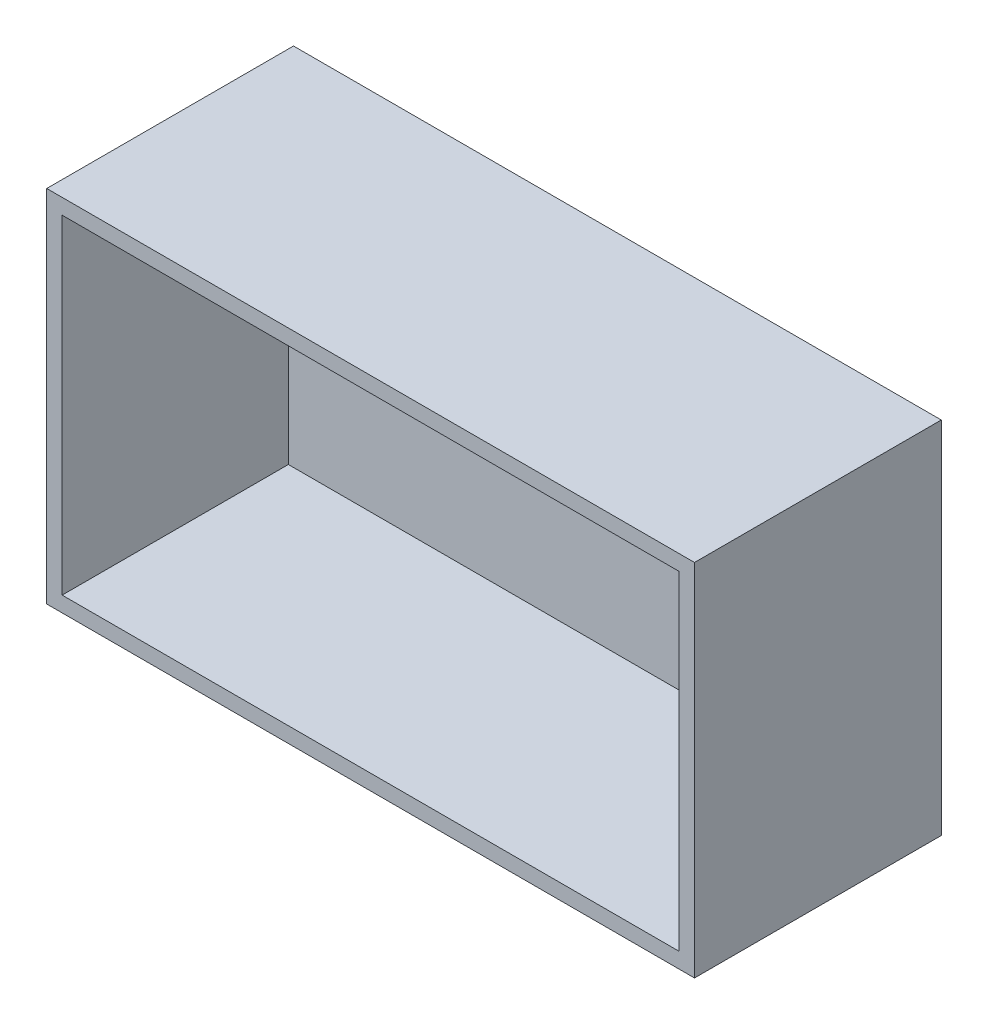
ISO-10303-21;
HEADER;
FILE_DESCRIPTION(('STEP AP214'),'2;1');
FILE_NAME('part.step','',(''),(''),'','','');
FILE_SCHEMA(('AUTOMOTIVE_DESIGN { 1 0 10303 214 1 1 1 1 }'));
ENDSEC;
DATA;
#1=APPLICATION_CONTEXT('core data for automotive mechanical design processes');
#2=APPLICATION_PROTOCOL_DEFINITION('international standard','automotive_design',2000,#1);
#3=PRODUCT_CONTEXT('',#1,'mechanical');
#4=PRODUCT('Part','Part','',(#3));
#5=PRODUCT_RELATED_PRODUCT_CATEGORY('part','',(#4));
#6=PRODUCT_DEFINITION_FORMATION('','',#4);
#7=PRODUCT_DEFINITION_CONTEXT('part definition',#1,'design');
#8=PRODUCT_DEFINITION('design','',#6,#7);
#9=PRODUCT_DEFINITION_SHAPE('','',#8);
#10=(LENGTH_UNIT() NAMED_UNIT(*) SI_UNIT(.MILLI.,.METRE.));
#11=(NAMED_UNIT(*) PLANE_ANGLE_UNIT() SI_UNIT($,.RADIAN.));
#12=(NAMED_UNIT(*) SI_UNIT($,.STERADIAN.) SOLID_ANGLE_UNIT());
#13=UNCERTAINTY_MEASURE_WITH_UNIT(LENGTH_MEASURE(1.E-05),#10,'distance_accuracy_value','');
#14=(GEOMETRIC_REPRESENTATION_CONTEXT(3) GLOBAL_UNCERTAINTY_ASSIGNED_CONTEXT((#13)) GLOBAL_UNIT_ASSIGNED_CONTEXT((#10,
#11,#12)) REPRESENTATION_CONTEXT('',''));
#15=CARTESIAN_POINT('',(0.,0.,0.));
#16=DIRECTION('',(0.,0.,1.));
#17=DIRECTION('',(1.,0.,0.));
#18=AXIS2_PLACEMENT_3D('',#15,#16,#17);
#19=CARTESIAN_POINT('',(31.5,17.5,24.));
#20=DIRECTION('',(-1.,0.,0.));
#21=DIRECTION('',(0.,0.,1.));
#22=AXIS2_PLACEMENT_3D('',#19,#20,#21);
#23=PLANE('',#22);
#24=DIRECTION('',(0.,1.,0.));
#25=VECTOR('',#24,1.);
#26=CARTESIAN_POINT('',(31.5,17.5,0.));
#27=LINE('',#26,#25);
#28=CARTESIAN_POINT('',(31.5,-17.5,0.));
#29=VERTEX_POINT('',#28);
#30=CARTESIAN_POINT('',(31.5,17.5,0.));
#31=VERTEX_POINT('',#30);
#32=EDGE_CURVE('E162',#29,#31,#27,.T.);
#33=ORIENTED_EDGE('',*,*,#32,.T.);
#34=DIRECTION('',(0.,0.,-1.));
#35=VECTOR('',#34,1.);
#36=CARTESIAN_POINT('',(31.5,17.5,24.));
#37=LINE('',#36,#35);
#38=CARTESIAN_POINT('',(31.5,17.5,24.));
#39=VERTEX_POINT('',#38);
#40=EDGE_CURVE('E11',#39,#31,#37,.T.);
#41=ORIENTED_EDGE('',*,*,#40,.F.);
#42=DIRECTION('',(0.,1.,0.));
#43=VECTOR('',#42,1.);
#44=CARTESIAN_POINT('',(31.5,17.5,24.));
#45=LINE('',#44,#43);
#46=CARTESIAN_POINT('',(31.5,-17.5,24.));
#47=VERTEX_POINT('',#46);
#48=EDGE_CURVE('E168',#47,#39,#45,.T.);
#49=ORIENTED_EDGE('',*,*,#48,.F.);
#50=DIRECTION('',(0.,0.,-1.));
#51=VECTOR('',#50,1.);
#52=CARTESIAN_POINT('',(31.5,-17.5,24.));
#53=LINE('',#52,#51);
#54=EDGE_CURVE('E178',#47,#29,#53,.T.);
#55=ORIENTED_EDGE('',*,*,#54,.T.);
#56=EDGE_LOOP('',(#33,#41,#49,#55));
#57=FACE_BOUND('',#56,.T.);
#58=ADVANCED_FACE('F43',(#57),#23,.F.);
#59=CARTESIAN_POINT('',(-31.5,17.5,24.));
#60=DIRECTION('',(0.,-1.,0.));
#61=DIRECTION('',(0.,0.,-1.));
#62=AXIS2_PLACEMENT_3D('',#59,#60,#61);
#63=PLANE('',#62);
#64=DIRECTION('',(-1.,0.,0.));
#65=VECTOR('',#64,1.);
#66=CARTESIAN_POINT('',(-31.5,17.5,0.));
#67=LINE('',#66,#65);
#68=CARTESIAN_POINT('',(-31.5,17.5,0.));
#69=VERTEX_POINT('',#68);
#70=EDGE_CURVE('E182',#31,#69,#67,.T.);
#71=ORIENTED_EDGE('',*,*,#70,.T.);
#72=DIRECTION('',(0.,0.,-1.));
#73=VECTOR('',#72,1.);
#74=CARTESIAN_POINT('',(-31.5,17.5,24.));
#75=LINE('',#74,#73);
#76=CARTESIAN_POINT('',(-31.5,17.5,24.));
#77=VERTEX_POINT('',#76);
#78=EDGE_CURVE('E51',#77,#69,#75,.T.);
#79=ORIENTED_EDGE('',*,*,#78,.F.);
#80=DIRECTION('',(-1.,0.,0.));
#81=VECTOR('',#80,1.);
#82=CARTESIAN_POINT('',(-31.5,17.5,24.));
#83=LINE('',#82,#81);
#84=EDGE_CURVE('E95',#39,#77,#83,.T.);
#85=ORIENTED_EDGE('',*,*,#84,.F.);
#86=ORIENTED_EDGE('',*,*,#40,.T.);
#87=EDGE_LOOP('',(#71,#79,#85,#86));
#88=FACE_BOUND('',#87,.T.);
#89=ADVANCED_FACE('F217',(#88),#63,.F.);
#90=CARTESIAN_POINT('',(-31.5,17.5,24.));
#91=DIRECTION('',(1.,0.,0.));
#92=DIRECTION('',(0.,1.,0.));
#93=AXIS2_PLACEMENT_3D('',#90,#91,#92);
#94=PLANE('',#93);
#95=DIRECTION('',(0.,-1.,0.));
#96=VECTOR('',#95,1.);
#97=CARTESIAN_POINT('',(-31.5,17.5,0.));
#98=LINE('',#97,#96);
#99=CARTESIAN_POINT('',(-31.5,-17.5,0.));
#100=VERTEX_POINT('',#99);
#101=EDGE_CURVE('E185',#69,#100,#98,.T.);
#102=ORIENTED_EDGE('',*,*,#101,.T.);
#103=DIRECTION('',(0.,0.,-1.));
#104=VECTOR('',#103,1.);
#105=CARTESIAN_POINT('',(-31.5,-17.5,24.));
#106=LINE('',#105,#104);
#107=CARTESIAN_POINT('',(-31.5,-17.5,24.));
#108=VERTEX_POINT('',#107);
#109=EDGE_CURVE('E192',#108,#100,#106,.T.);
#110=ORIENTED_EDGE('',*,*,#109,.F.);
#111=DIRECTION('',(0.,-1.,0.));
#112=VECTOR('',#111,1.);
#113=CARTESIAN_POINT('',(-31.5,17.5,24.));
#114=LINE('',#113,#112);
#115=EDGE_CURVE('E173',#77,#108,#114,.T.);
#116=ORIENTED_EDGE('',*,*,#115,.F.);
#117=ORIENTED_EDGE('',*,*,#78,.T.);
#118=EDGE_LOOP('',(#102,#110,#116,#117));
#119=FACE_BOUND('',#118,.T.);
#120=ADVANCED_FACE('F199',(#119),#94,.F.);
#121=CARTESIAN_POINT('',(-31.5,-17.5,24.));
#122=DIRECTION('',(0.,1.,0.));
#123=DIRECTION('',(0.,0.,1.));
#124=AXIS2_PLACEMENT_3D('',#121,#122,#123);
#125=PLANE('',#124);
#126=DIRECTION('',(1.,0.,0.));
#127=VECTOR('',#126,1.);
#128=CARTESIAN_POINT('',(-31.5,-17.5,0.));
#129=LINE('',#128,#127);
#130=EDGE_CURVE('E88',#100,#29,#129,.T.);
#131=ORIENTED_EDGE('',*,*,#130,.T.);
#132=ORIENTED_EDGE('',*,*,#54,.F.);
#133=DIRECTION('',(1.,0.,0.));
#134=VECTOR('',#133,1.);
#135=CARTESIAN_POINT('',(-31.5,-17.5,24.));
#136=LINE('',#135,#134);
#137=EDGE_CURVE('E67',#108,#47,#136,.T.);
#138=ORIENTED_EDGE('',*,*,#137,.F.);
#139=ORIENTED_EDGE('',*,*,#109,.T.);
#140=EDGE_LOOP('',(#131,#132,#138,#139));
#141=FACE_BOUND('',#140,.T.);
#142=ADVANCED_FACE('F207',(#141),#125,.F.);
#143=CARTESIAN_POINT('',(0.,0.,24.));
#144=DIRECTION('',(0.,0.,1.));
#145=DIRECTION('',(1.,0.,0.));
#146=AXIS2_PLACEMENT_3D('',#143,#144,#145);
#147=PLANE('',#146);
#148=DIRECTION('',(0.,1.,0.));
#149=VECTOR('',#148,1.);
#150=CARTESIAN_POINT('',(30.,16.,24.));
#151=LINE('',#150,#149);
#152=CARTESIAN_POINT('',(30.,-16.,24.));
#153=VERTEX_POINT('',#152);
#154=CARTESIAN_POINT('',(30.,16.,24.));
#155=VERTEX_POINT('',#154);
#156=EDGE_CURVE('E58',#153,#155,#151,.T.);
#157=ORIENTED_EDGE('',*,*,#156,.F.);
#158=DIRECTION('',(1.,0.,0.));
#159=VECTOR('',#158,1.);
#160=CARTESIAN_POINT('',(-30.,-16.,24.));
#161=LINE('',#160,#159);
#162=CARTESIAN_POINT('',(-30.,-16.,24.));
#163=VERTEX_POINT('',#162);
#164=EDGE_CURVE('E140',#163,#153,#161,.T.);
#165=ORIENTED_EDGE('',*,*,#164,.F.);
#166=DIRECTION('',(0.,-1.,0.));
#167=VECTOR('',#166,1.);
#168=CARTESIAN_POINT('',(-30.,16.,24.));
#169=LINE('',#168,#167);
#170=CARTESIAN_POINT('',(-30.,16.,24.));
#171=VERTEX_POINT('',#170);
#172=EDGE_CURVE('E144',#171,#163,#169,.T.);
#173=ORIENTED_EDGE('',*,*,#172,.F.);
#174=DIRECTION('',(-1.,0.,0.));
#175=VECTOR('',#174,1.);
#176=CARTESIAN_POINT('',(-30.,16.,24.));
#177=LINE('',#176,#175);
#178=EDGE_CURVE('E153',#155,#171,#177,.T.);
#179=ORIENTED_EDGE('',*,*,#178,.F.);
#180=EDGE_LOOP('',(#157,#165,#173,#179));
#181=FACE_BOUND('',#180,.T.);
#182=ORIENTED_EDGE('',*,*,#48,.T.);
#183=ORIENTED_EDGE('',*,*,#84,.T.);
#184=ORIENTED_EDGE('',*,*,#115,.T.);
#185=ORIENTED_EDGE('',*,*,#137,.T.);
#186=EDGE_LOOP('',(#182,#183,#184,#185));
#187=FACE_BOUND('',#186,.T.);
#188=ADVANCED_FACE('F209',(#181,#187),#147,.T.);
#189=CARTESIAN_POINT('',(0.,0.,0.));
#190=DIRECTION('',(0.,0.,1.));
#191=DIRECTION('',(1.,0.,0.));
#192=AXIS2_PLACEMENT_3D('',#189,#190,#191);
#193=PLANE('',#192);
#194=ORIENTED_EDGE('',*,*,#32,.F.);
#195=ORIENTED_EDGE('',*,*,#130,.F.);
#196=ORIENTED_EDGE('',*,*,#101,.F.);
#197=ORIENTED_EDGE('',*,*,#70,.F.);
#198=EDGE_LOOP('',(#194,#195,#196,#197));
#199=FACE_BOUND('',#198,.T.);
#200=ADVANCED_FACE('F203',(#199),#193,.F.);
#201=CARTESIAN_POINT('',(30.,16.,2.));
#202=DIRECTION('',(1.,0.,0.));
#203=DIRECTION('',(0.,1.,0.));
#204=AXIS2_PLACEMENT_3D('',#201,#202,#203);
#205=PLANE('',#204);
#206=ORIENTED_EDGE('',*,*,#156,.T.);
#207=DIRECTION('',(0.,0.,1.));
#208=VECTOR('',#207,1.);
#209=CARTESIAN_POINT('',(30.,16.,2.));
#210=LINE('',#209,#208);
#211=CARTESIAN_POINT('',(30.,16.,2.));
#212=VERTEX_POINT('',#211);
#213=EDGE_CURVE('E115',#212,#155,#210,.T.);
#214=ORIENTED_EDGE('',*,*,#213,.F.);
#215=DIRECTION('',(0.,1.,0.));
#216=VECTOR('',#215,1.);
#217=CARTESIAN_POINT('',(30.,16.,2.));
#218=LINE('',#217,#216);
#219=CARTESIAN_POINT('',(30.,-16.,2.));
#220=VERTEX_POINT('',#219);
#221=EDGE_CURVE('E119',#220,#212,#218,.T.);
#222=ORIENTED_EDGE('',*,*,#221,.F.);
#223=DIRECTION('',(0.,0.,1.));
#224=VECTOR('',#223,1.);
#225=CARTESIAN_POINT('',(30.,-16.,2.));
#226=LINE('',#225,#224);
#227=EDGE_CURVE('E159',#220,#153,#226,.T.);
#228=ORIENTED_EDGE('',*,*,#227,.T.);
#229=EDGE_LOOP('',(#206,#214,#222,#228));
#230=FACE_BOUND('',#229,.T.);
#231=ADVANCED_FACE('F117',(#230),#205,.F.);
#232=CARTESIAN_POINT('',(-30.,-16.,2.));
#233=DIRECTION('',(0.,-1.,0.));
#234=DIRECTION('',(0.,0.,-1.));
#235=AXIS2_PLACEMENT_3D('',#232,#233,#234);
#236=PLANE('',#235);
#237=ORIENTED_EDGE('',*,*,#164,.T.);
#238=ORIENTED_EDGE('',*,*,#227,.F.);
#239=DIRECTION('',(1.,0.,0.));
#240=VECTOR('',#239,1.);
#241=CARTESIAN_POINT('',(-30.,-16.,2.));
#242=LINE('',#241,#240);
#243=CARTESIAN_POINT('',(-30.,-16.,2.));
#244=VERTEX_POINT('',#243);
#245=EDGE_CURVE('E126',#244,#220,#242,.T.);
#246=ORIENTED_EDGE('',*,*,#245,.F.);
#247=DIRECTION('',(0.,0.,1.));
#248=VECTOR('',#247,1.);
#249=CARTESIAN_POINT('',(-30.,-16.,2.));
#250=LINE('',#249,#248);
#251=EDGE_CURVE('E163',#244,#163,#250,.T.);
#252=ORIENTED_EDGE('',*,*,#251,.T.);
#253=EDGE_LOOP('',(#237,#238,#246,#252));
#254=FACE_BOUND('',#253,.T.);
#255=ADVANCED_FACE('F260',(#254),#236,.F.);
#256=CARTESIAN_POINT('',(-30.,16.,2.));
#257=DIRECTION('',(-1.,0.,0.));
#258=DIRECTION('',(0.,-1.,0.));
#259=AXIS2_PLACEMENT_3D('',#256,#257,#258);
#260=PLANE('',#259);
#261=ORIENTED_EDGE('',*,*,#172,.T.);
#262=ORIENTED_EDGE('',*,*,#251,.F.);
#263=DIRECTION('',(0.,-1.,0.));
#264=VECTOR('',#263,1.);
#265=CARTESIAN_POINT('',(-30.,16.,2.));
#266=LINE('',#265,#264);
#267=CARTESIAN_POINT('',(-30.,16.,2.));
#268=VERTEX_POINT('',#267);
#269=EDGE_CURVE('E135',#268,#244,#266,.T.);
#270=ORIENTED_EDGE('',*,*,#269,.F.);
#271=DIRECTION('',(0.,0.,1.));
#272=VECTOR('',#271,1.);
#273=CARTESIAN_POINT('',(-30.,16.,2.));
#274=LINE('',#273,#272);
#275=EDGE_CURVE('E125',#268,#171,#274,.T.);
#276=ORIENTED_EDGE('',*,*,#275,.T.);
#277=EDGE_LOOP('',(#261,#262,#270,#276));
#278=FACE_BOUND('',#277,.T.);
#279=ADVANCED_FACE('F270',(#278),#260,.F.);
#280=CARTESIAN_POINT('',(-30.,16.,2.));
#281=DIRECTION('',(0.,1.,0.));
#282=DIRECTION('',(0.,0.,1.));
#283=AXIS2_PLACEMENT_3D('',#280,#281,#282);
#284=PLANE('',#283);
#285=ORIENTED_EDGE('',*,*,#178,.T.);
#286=ORIENTED_EDGE('',*,*,#275,.F.);
#287=DIRECTION('',(-1.,0.,0.));
#288=VECTOR('',#287,1.);
#289=CARTESIAN_POINT('',(-30.,16.,2.));
#290=LINE('',#289,#288);
#291=EDGE_CURVE('E129',#212,#268,#290,.T.);
#292=ORIENTED_EDGE('',*,*,#291,.F.);
#293=ORIENTED_EDGE('',*,*,#213,.T.);
#294=EDGE_LOOP('',(#285,#286,#292,#293));
#295=FACE_BOUND('',#294,.T.);
#296=ADVANCED_FACE('F130',(#295),#284,.F.);
#297=CARTESIAN_POINT('',(0.,0.,2.));
#298=DIRECTION('',(0.,0.,1.));
#299=DIRECTION('',(1.,0.,0.));
#300=AXIS2_PLACEMENT_3D('',#297,#298,#299);
#301=PLANE('',#300);
#302=ORIENTED_EDGE('',*,*,#221,.T.);
#303=ORIENTED_EDGE('',*,*,#291,.T.);
#304=ORIENTED_EDGE('',*,*,#269,.T.);
#305=ORIENTED_EDGE('',*,*,#245,.T.);
#306=EDGE_LOOP('',(#302,#303,#304,#305));
#307=FACE_BOUND('',#306,.T.);
#308=ADVANCED_FACE('F137',(#307),#301,.T.);
#309=CLOSED_SHELL('',(#58,#89,#120,#142,#188,#200,#231,#255,#279,#296,#308));
#310=MANIFOLD_SOLID_BREP('B2',#309);
#311=ADVANCED_BREP_SHAPE_REPRESENTATION('',(#18,#310),#14);
#312=SHAPE_DEFINITION_REPRESENTATION(#9,#311);
ENDSEC;
END-ISO-10303-21;
